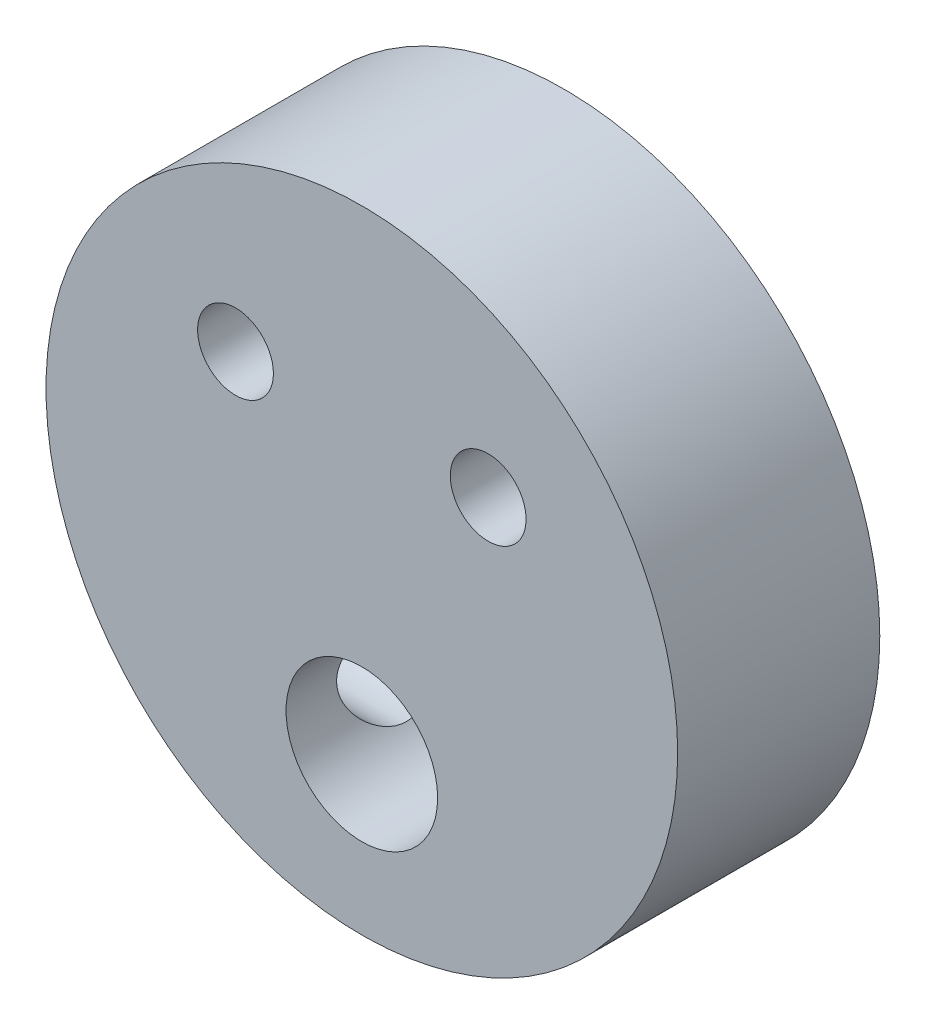
ISO-10303-21;
HEADER;
FILE_DESCRIPTION(('STEP AP214'),'2;1');
FILE_NAME('part.step','',(''),(''),'','','');
FILE_SCHEMA(('AUTOMOTIVE_DESIGN { 1 0 10303 214 1 1 1 1 }'));
ENDSEC;
DATA;
#1=APPLICATION_CONTEXT('core data for automotive mechanical design processes');
#2=APPLICATION_PROTOCOL_DEFINITION('international standard','automotive_design',2000,#1);
#3=PRODUCT_CONTEXT('',#1,'mechanical');
#4=PRODUCT('Part','Part','',(#3));
#5=PRODUCT_RELATED_PRODUCT_CATEGORY('part','',(#4));
#6=PRODUCT_DEFINITION_FORMATION('','',#4);
#7=PRODUCT_DEFINITION_CONTEXT('part definition',#1,'design');
#8=PRODUCT_DEFINITION('design','',#6,#7);
#9=PRODUCT_DEFINITION_SHAPE('','',#8);
#10=(LENGTH_UNIT() NAMED_UNIT(*) SI_UNIT(.MILLI.,.METRE.));
#11=(NAMED_UNIT(*) PLANE_ANGLE_UNIT() SI_UNIT($,.RADIAN.));
#12=(NAMED_UNIT(*) SI_UNIT($,.STERADIAN.) SOLID_ANGLE_UNIT());
#13=UNCERTAINTY_MEASURE_WITH_UNIT(LENGTH_MEASURE(1.E-05),#10,'distance_accuracy_value','');
#14=(GEOMETRIC_REPRESENTATION_CONTEXT(3) GLOBAL_UNCERTAINTY_ASSIGNED_CONTEXT((#13)) GLOBAL_UNIT_ASSIGNED_CONTEXT((#10,
#11,#12)) REPRESENTATION_CONTEXT('',''));
#15=CARTESIAN_POINT('',(0.,0.,0.));
#16=DIRECTION('',(0.,0.,1.));
#17=DIRECTION('',(1.,0.,0.));
#18=AXIS2_PLACEMENT_3D('',#15,#16,#17);
#19=CARTESIAN_POINT('',(0.,0.,8.));
#20=DIRECTION('',(0.,0.,1.));
#21=DIRECTION('',(1.,0.,0.));
#22=AXIS2_PLACEMENT_3D('',#19,#20,#21);
#23=PLANE('',#22);
#24=CARTESIAN_POINT('',(5.,5.,8.));
#25=DIRECTION('',(0.,0.,1.));
#26=DIRECTION('',(-1.,0.,0.));
#27=AXIS2_PLACEMENT_3D('',#24,#25,#26);
#28=CIRCLE('',#27,1.5);
#29=CARTESIAN_POINT('',(3.5,5.,8.));
#30=VERTEX_POINT('',#29);
#31=EDGE_CURVE('E110',#30,#30,#28,.T.);
#32=ORIENTED_EDGE('',*,*,#31,.F.);
#33=EDGE_LOOP('',(#32));
#34=FACE_BOUND('',#33,.T.);
#35=CARTESIAN_POINT('',(-5.,5.,8.));
#36=DIRECTION('',(0.,0.,1.));
#37=DIRECTION('',(1.,0.,0.));
#38=AXIS2_PLACEMENT_3D('',#35,#36,#37);
#39=CIRCLE('',#38,1.5);
#40=CARTESIAN_POINT('',(-3.5,5.,8.));
#41=VERTEX_POINT('',#40);
#42=EDGE_CURVE('E69',#41,#41,#39,.T.);
#43=ORIENTED_EDGE('',*,*,#42,.F.);
#44=EDGE_LOOP('',(#43));
#45=FACE_BOUND('',#44,.T.);
#46=CARTESIAN_POINT('',(0.,0.,8.));
#47=DIRECTION('',(0.,0.,1.));
#48=DIRECTION('',(1.,0.,0.));
#49=AXIS2_PLACEMENT_3D('',#46,#47,#48);
#50=CIRCLE('',#49,12.5);
#51=CARTESIAN_POINT('',(12.5,0.,8.));
#52=VERTEX_POINT('',#51);
#53=EDGE_CURVE('E10',#52,#52,#50,.T.);
#54=ORIENTED_EDGE('',*,*,#53,.T.);
#55=EDGE_LOOP('',(#54));
#56=FACE_BOUND('',#55,.T.);
#57=CARTESIAN_POINT('',(0.,-6.3,8.));
#58=DIRECTION('',(0.,0.,1.));
#59=DIRECTION('',(1.,0.,0.));
#60=AXIS2_PLACEMENT_3D('',#57,#58,#59);
#61=CIRCLE('',#60,3.);
#62=CARTESIAN_POINT('',(3.,-6.3,8.));
#63=VERTEX_POINT('',#62);
#64=EDGE_CURVE('E57',#63,#63,#61,.T.);
#65=ORIENTED_EDGE('',*,*,#64,.F.);
#66=EDGE_LOOP('',(#65));
#67=FACE_BOUND('',#66,.T.);
#68=ADVANCED_FACE('F39',(#34,#45,#56,#67),#23,.T.);
#69=CARTESIAN_POINT('',(0.,0.,0.));
#70=DIRECTION('',(0.,0.,1.));
#71=DIRECTION('',(1.,0.,0.));
#72=AXIS2_PLACEMENT_3D('',#69,#70,#71);
#73=PLANE('',#72);
#74=CARTESIAN_POINT('',(5.,5.,0.));
#75=DIRECTION('',(0.,0.,1.));
#76=DIRECTION('',(-1.,0.,0.));
#77=AXIS2_PLACEMENT_3D('',#74,#75,#76);
#78=CIRCLE('',#77,1.5);
#79=CARTESIAN_POINT('',(3.5,5.,0.));
#80=VERTEX_POINT('',#79);
#81=EDGE_CURVE('E96',#80,#80,#78,.T.);
#82=ORIENTED_EDGE('',*,*,#81,.T.);
#83=EDGE_LOOP('',(#82));
#84=FACE_BOUND('',#83,.T.);
#85=CARTESIAN_POINT('',(-5.,5.,0.));
#86=DIRECTION('',(0.,0.,1.));
#87=DIRECTION('',(1.,0.,0.));
#88=AXIS2_PLACEMENT_3D('',#85,#86,#87);
#89=CIRCLE('',#88,1.5);
#90=CARTESIAN_POINT('',(-3.5,5.,0.));
#91=VERTEX_POINT('',#90);
#92=EDGE_CURVE('E100',#91,#91,#89,.T.);
#93=ORIENTED_EDGE('',*,*,#92,.T.);
#94=EDGE_LOOP('',(#93));
#95=FACE_BOUND('',#94,.T.);
#96=CARTESIAN_POINT('',(0.,0.,0.));
#97=DIRECTION('',(0.,0.,1.));
#98=DIRECTION('',(1.,0.,0.));
#99=AXIS2_PLACEMENT_3D('',#96,#97,#98);
#100=CIRCLE('',#99,12.5);
#101=CARTESIAN_POINT('',(12.5,0.,0.));
#102=VERTEX_POINT('',#101);
#103=EDGE_CURVE('E52',#102,#102,#100,.T.);
#104=ORIENTED_EDGE('',*,*,#103,.F.);
#105=EDGE_LOOP('',(#104));
#106=FACE_BOUND('',#105,.T.);
#107=CARTESIAN_POINT('',(0.,-6.3,0.));
#108=DIRECTION('',(0.,0.,1.));
#109=DIRECTION('',(1.,0.,0.));
#110=AXIS2_PLACEMENT_3D('',#107,#108,#109);
#111=CIRCLE('',#110,3.);
#112=CARTESIAN_POINT('',(3.,-6.3,0.));
#113=VERTEX_POINT('',#112);
#114=EDGE_CURVE('E59',#113,#113,#111,.T.);
#115=ORIENTED_EDGE('',*,*,#114,.T.);
#116=EDGE_LOOP('',(#115));
#117=FACE_BOUND('',#116,.T.);
#118=ADVANCED_FACE('F85',(#84,#95,#106,#117),#73,.F.);
#119=CARTESIAN_POINT('',(0.,0.,8.));
#120=DIRECTION('',(0.,0.,-1.));
#121=DIRECTION('',(-1.,0.,0.));
#122=AXIS2_PLACEMENT_3D('',#119,#120,#121);
#123=CYLINDRICAL_SURFACE('',#122,12.5);
#124=CARTESIAN_POINT('',(-10.7962956610126,-6.3,2.));
#125=CARTESIAN_POINT('',(-10.8649366877148,-6.18237069527315,2.00000130589695));
#126=CARTESIAN_POINT('',(-10.9316469644138,-6.06359707464161,2.01038122678109));
#127=CARTESIAN_POINT('',(-11.0595852579452,-5.82697504599017,2.05303242275279));
#128=CARTESIAN_POINT('',(-11.1208149189282,-5.70912637023689,2.08529710746416));
#129=CARTESIAN_POINT('',(-11.2366156917357,-5.47770950958708,2.17264897036098));
#130=CARTESIAN_POINT('',(-11.2911478564412,-5.36416879230078,2.22786214444508));
#131=CARTESIAN_POINT('',(-11.3917974879485,-5.14696770871515,2.36088451895591));
#132=CARTESIAN_POINT('',(-11.4379196143042,-5.04330188656248,2.4386811447825));
#133=CARTESIAN_POINT('',(-11.5164507400641,-4.86109053362144,2.6060049443053));
#134=CARTESIAN_POINT('',(-11.5497864743858,-4.7810542384566,2.69347456989609));
#135=CARTESIAN_POINT('',(-11.6084601444414,-4.63678062814349,2.88292787855692));
#136=CARTESIAN_POINT('',(-11.6338027053872,-4.57253418104383,2.98490311826686));
#137=CARTESIAN_POINT('',(-11.6743991790149,-4.46780589376754,3.19056069419096));
#138=CARTESIAN_POINT('',(-11.6903469598331,-4.42572515947065,3.29329497593935));
#139=CARTESIAN_POINT('',(-11.7153799535084,-4.35903139287314,3.50507386514289));
#140=CARTESIAN_POINT('',(-11.7244671983475,-4.33441318857895,3.61411659382622));
#141=CARTESIAN_POINT('',(-11.7355372653604,-4.30434778295202,3.8303587168017));
#142=CARTESIAN_POINT('',(-11.7378086174888,-4.29812217344296,3.93743594255018));
#143=CARTESIAN_POINT('',(-11.7360731241747,-4.30285893359846,4.15115240151094));
#144=CARTESIAN_POINT('',(-11.7320669912979,-4.31381935245423,4.25779168305726));
#145=CARTESIAN_POINT('',(-11.7178552784849,-4.35227237257084,4.4663402921219));
#146=CARTESIAN_POINT('',(-11.7077211519571,-4.37957439139583,4.5682897767546));
#147=CARTESIAN_POINT('',(-11.6813226067318,-4.44950438714808,4.7659340206541));
#148=CARTESIAN_POINT('',(-11.6650582061838,-4.49213231870093,4.86162879843779));
#149=CARTESIAN_POINT('',(-11.6262170848826,-4.59172674054136,5.04539886555993));
#150=CARTESIAN_POINT('',(-11.6035652991023,-4.64886288545767,5.13336615294694));
#151=CARTESIAN_POINT('',(-11.5521943870411,-4.77508498007818,5.2982367835111));
#152=CARTESIAN_POINT('',(-11.5234745549987,-4.84417231963085,5.37513883796404));
#153=CARTESIAN_POINT('',(-11.4590005574753,-4.99482389638299,5.51914422665209));
#154=CARTESIAN_POINT('',(-11.4230124959399,-5.07677442862093,5.58573768811275));
#155=CARTESIAN_POINT('',(-11.3452868138284,-5.2481733459533,5.70426799246006));
#156=CARTESIAN_POINT('',(-11.3035476561078,-5.33762373308718,5.75620090554477));
#157=CARTESIAN_POINT('',(-11.2116368543699,-5.52821826276422,5.84834545275278));
#158=CARTESIAN_POINT('',(-11.1610673487076,-5.62973611235101,5.88738399616389));
#159=CARTESIAN_POINT('',(-11.0549846242545,-5.8352992017499,5.94821962988211));
#160=CARTESIAN_POINT('',(-10.9994692688457,-5.93934551961244,5.97000922802997));
#161=CARTESIAN_POINT('',(-10.8782307360474,-6.1588530183683,5.99840701917676));
#162=CARTESIAN_POINT('',(-10.8120559901808,-6.27431342400384,6.00308605060478));
#163=CARTESIAN_POINT('',(-10.6764403556972,-6.5024046531181,5.99300838473509));
#164=CARTESIAN_POINT('',(-10.606998201105,-6.61503435345942,5.97824409321704));
#165=CARTESIAN_POINT('',(-10.4581677528888,-6.84821240663778,5.9275184794899));
#166=CARTESIAN_POINT('',(-10.3785707443632,-6.9681326575348,5.88926695762781));
#167=CARTESIAN_POINT('',(-10.2196942240947,-7.19913526530239,5.79090577079903));
#168=CARTESIAN_POINT('',(-10.1404153085222,-7.31020508775293,5.73076575411207));
#169=CARTESIAN_POINT('',(-9.98085627080246,-7.52672460793877,5.58528607459298));
#170=CARTESIAN_POINT('',(-9.90077491993191,-7.63149704771814,5.49870940322805));
#171=CARTESIAN_POINT('',(-9.74928480399286,-7.82408942338587,5.30229510962414));
#172=CARTESIAN_POINT('',(-9.67785399950012,-7.91195279121945,5.19251864316908));
#173=CARTESIAN_POINT('',(-9.5733086834854,-8.03777938274011,4.99424705237903));
#174=CARTESIAN_POINT('',(-9.53565347841991,-8.08232390502388,4.91229888936658));
#175=CARTESIAN_POINT('',(-9.46889367859734,-8.16043409323015,4.74006735663763));
#176=CARTESIAN_POINT('',(-9.43978068607288,-8.19401054546248,4.64979228858687));
#177=CARTESIAN_POINT('',(-9.39225727482981,-8.24844507439244,4.46175409933778));
#178=CARTESIAN_POINT('',(-9.37394727040775,-8.2691839094925,4.36392999540332));
#179=CARTESIAN_POINT('',(-9.35046918663304,-8.29572563742649,4.16474035759088));
#180=CARTESIAN_POINT('',(-9.34528867190936,-8.30154266325972,4.06337826699305));
#181=CARTESIAN_POINT('',(-9.34842369975954,-8.29800927813179,3.87520890616928));
#182=CARTESIAN_POINT('',(-9.35497524291072,-8.29064142019131,3.78832363424958));
#183=CARTESIAN_POINT('',(-9.3776541007723,-8.26497991884146,3.61748799264687));
#184=CARTESIAN_POINT('',(-9.39378266281148,-8.24668485225025,3.53353800676934));
#185=CARTESIAN_POINT('',(-9.43427964734514,-8.20032307385571,3.37077498801068));
#186=CARTESIAN_POINT('',(-9.45862725254706,-8.17228104400903,3.29194957121306));
#187=CARTESIAN_POINT('',(-9.51402378868507,-8.10772241022006,3.14038509755485));
#188=CARTESIAN_POINT('',(-9.54507691297166,-8.07120050223717,3.06764988893481));
#189=CARTESIAN_POINT('',(-9.62792375817383,-7.97238405375417,2.89689193821969));
#190=CARTESIAN_POINT('',(-9.6826779654831,-7.90597149180829,2.80267727519787));
#191=CARTESIAN_POINT('',(-9.79936604220943,-7.76087124565528,2.62935158943545));
#192=CARTESIAN_POINT('',(-9.86131186702781,-7.6821630438064,2.55026631277227));
#193=CARTESIAN_POINT('',(-9.9903765785454,-7.51357545136832,2.40635656153163));
#194=CARTESIAN_POINT('',(-10.0575612924677,-7.42354039940732,2.34177484910889));
#195=CARTESIAN_POINT('',(-10.1938434968195,-7.23526596644374,2.22874758871046));
#196=CARTESIAN_POINT('',(-10.2629407035567,-7.13702779794822,2.1802996612533));
#197=CARTESIAN_POINT('',(-10.4109491349442,-6.91966349227609,2.09434319788151));
#198=CARTESIAN_POINT('',(-10.4898710563053,-6.7995447725347,2.05933867639567));
#199=CARTESIAN_POINT('',(-10.6453818655481,-6.55339812138086,2.01216580951527));
#200=CARTESIAN_POINT('',(-10.7219706386359,-6.42736989998568,1.99999858596491));
#201=CARTESIAN_POINT('',(-10.7962956610126,-6.3,2.));
#202=B_SPLINE_CURVE_WITH_KNOTS('',3,(#124,#125,#126,#127,#128,#129,#130,#131,#132,#133,#134,
#135,#136,#137,#138,#139,#140,#141,#142,#143,#144,#145,#146,#147,#148,#149,#150,#151,#152,#153,
#154,#155,#156,#157,#158,#159,#160,#161,#162,#163,#164,#165,#166,#167,#168,#169,#170,#171,#172,
#173,#174,#175,#176,#177,#178,#179,#180,#181,#182,#183,#184,#185,#186,#187,#188,#189,#190,#191,
#192,#193,#194,#195,#196,#197,#198,#199,#200,#201),.UNSPECIFIED.,.T.,.F.,(4,2,2,2,2,2,2,2,2,2,2,
2,2,2,2,2,2,2,2,2,2,2,2,2,2,2,2,2,2,2,2,2,2,2,2,2,2,2,4),(0.,0.40813309128024,0.816143331924971,
1.22642393041372,1.63647651898227,2.00394061916668,2.37119169622337,2.70597302396906,
3.04065515585564,3.36095431390031,3.68121711699623,3.99781573503227,4.31441341574347,
4.63489904343964,4.95542196667756,5.28866277765706,5.62199283015434,5.98035461234499,
6.33887196535769,6.7367463897825,7.13477626306711,7.57965072963226,8.0251444472132,
8.49593480500251,8.96549928014663,9.26617336355885,9.5665508590994,9.86967810091383,
10.1725181334835,10.433561190823,10.6946382543563,10.9550589592419,11.2156429944047,
11.5964053629921,11.977810030889,12.3651884864,12.7525097843064,13.1944176720484,
13.6363472672111),.UNSPECIFIED.);
#203=CARTESIAN_POINT('',(-10.7962956610126,-6.3,2.));
#204=VERTEX_POINT('',#203);
#205=EDGE_CURVE('E62',#204,#204,#202,.T.);
#206=ORIENTED_EDGE('',*,*,#205,.T.);
#207=EDGE_LOOP('',(#206));
#208=FACE_BOUND('',#207,.T.);
#209=ORIENTED_EDGE('',*,*,#53,.F.);
#210=EDGE_LOOP('',(#209));
#211=FACE_BOUND('',#210,.T.);
#212=ORIENTED_EDGE('',*,*,#103,.T.);
#213=EDGE_LOOP('',(#212));
#214=FACE_BOUND('',#213,.T.);
#215=ADVANCED_FACE('F41',(#208,#211,#214),#123,.T.);
#216=CARTESIAN_POINT('',(0.,-6.3,8.));
#217=DIRECTION('',(0.,0.,-1.));
#218=DIRECTION('',(-1.,0.,0.));
#219=AXIS2_PLACEMENT_3D('',#216,#217,#218);
#220=CYLINDRICAL_SURFACE('',#219,3.);
#221=CARTESIAN_POINT('',(-3.,-6.3,6.));
#222=CARTESIAN_POINT('',(-3.00000041644839,-6.40048471666808,6.00000054963247));
#223=CARTESIAN_POINT('',(-2.99490802753388,-6.5009690871329,5.9923860300445));
#224=CARTESIAN_POINT('',(-2.97504652423808,-6.69873305803168,5.96240313589434));
#225=CARTESIAN_POINT('',(-2.96027281581235,-6.79601111395501,5.94002775687671));
#226=CARTESIAN_POINT('',(-2.92250482404708,-6.98421230785425,5.88189228267516));
#227=CARTESIAN_POINT('',(-2.89954905493315,-7.07516287265755,5.84619485999206));
#228=CARTESIAN_POINT('',(-2.8472613787744,-7.24941529099726,5.7629366367285));
#229=CARTESIAN_POINT('',(-2.8179285460551,-7.33271603160967,5.71537411369944));
#230=CARTESIAN_POINT('',(-2.75227329369838,-7.49728470077011,5.60534306263257));
#231=CARTESIAN_POINT('',(-2.71556897579319,-7.57778030546068,5.54195213925711));
#232=CARTESIAN_POINT('',(-2.63982313083466,-7.72772804469274,5.40426995134155));
#233=CARTESIAN_POINT('',(-2.60077830356832,-7.79716405543888,5.32996307016226));
#234=CARTESIAN_POINT('',(-2.51728264678793,-7.93422297745496,5.15894763238733));
#235=CARTESIAN_POINT('',(-2.47295067937795,-7.9998318636275,5.06055434679655));
#236=CARTESIAN_POINT('',(-2.3908414735282,-8.11350357014175,4.85163662235347));
#237=CARTESIAN_POINT('',(-2.35305295954667,-8.16159673426503,4.74113359843726));
#238=CARTESIAN_POINT('',(-2.2997626664146,-8.22674035011438,4.54328870657837));
#239=CARTESIAN_POINT('',(-2.28097627892403,-8.24874447236008,4.45847154712609));
#240=CARTESIAN_POINT('',(-2.25257969659604,-8.28150617785229,4.28525549525835));
#241=CARTESIAN_POINT('',(-2.24295368744147,-8.29228314651963,4.19686305127394));
#242=CARTESIAN_POINT('',(-2.23436605608045,-8.30191364141228,4.01852522114353));
#243=CARTESIAN_POINT('',(-2.23544802558502,-8.30071842917524,3.9285749765476));
#244=CARTESIAN_POINT('',(-2.24819775483425,-8.28637581333356,3.75036502650025));
#245=CARTESIAN_POINT('',(-2.25987448286881,-8.27321828380393,3.66210681797187));
#246=CARTESIAN_POINT('',(-2.29127185989959,-8.23664994217326,3.49353294875812));
#247=CARTESIAN_POINT('',(-2.31061488324375,-8.21371711479477,3.41303866406123));
#248=CARTESIAN_POINT('',(-2.35509622933623,-8.15870118583424,3.25697630902422));
#249=CARTESIAN_POINT('',(-2.38023645854889,-8.1266150732855,3.18140986976135));
#250=CARTESIAN_POINT('',(-2.43964196377947,-8.04673818732649,3.02097460464356));
#251=CARTESIAN_POINT('',(-2.47472317740626,-7.99708052300445,2.93734009951691));
#252=CARTESIAN_POINT('',(-2.54691537733438,-7.88668960438221,2.77861660471425));
#253=CARTESIAN_POINT('',(-2.58402882709328,-7.82594268999614,2.70353834223793));
#254=CARTESIAN_POINT('',(-2.66543343763724,-7.67981165322309,2.54745745439658));
#255=CARTESIAN_POINT('',(-2.7095474472056,-7.59193938283656,2.46866595131724));
#256=CARTESIAN_POINT('',(-2.79218100665211,-7.40200799908008,2.32680350546152));
#257=CARTESIAN_POINT('',(-2.83070577648042,-7.2999622993437,2.26371785459102));
#258=CARTESIAN_POINT('',(-2.89145404090364,-7.10485782709653,2.16652228137713));
#259=CARTESIAN_POINT('',(-2.91539261165539,-7.01395764337191,2.12915663666106));
#260=CARTESIAN_POINT('',(-2.95507719030498,-6.82603604393548,2.06789507437463));
#261=CARTESIAN_POINT('',(-2.97083012127543,-6.72901987900165,2.04398777286779));
#262=CARTESIAN_POINT('',(-2.99275882156808,-6.53098545317228,2.010838834762));
#263=CARTESIAN_POINT('',(-2.99889322461186,-6.42995181193416,2.00166053906174));
#264=CARTESIAN_POINT('',(-3.00083114965146,-6.22755848061066,1.99875291143779));
#265=CARTESIAN_POINT('',(-2.99663539385634,-6.12619881381338,2.00502249951123));
#266=CARTESIAN_POINT('',(-2.97899589424273,-5.93354428279576,2.03162405556195));
#267=CARTESIAN_POINT('',(-2.96622246390226,-5.84204255532081,2.05093729775522));
#268=CARTESIAN_POINT('',(-2.93318449284837,-5.6638836075726,2.10159568601286));
#269=CARTESIAN_POINT('',(-2.91291875746988,-5.57722716242887,2.13294275092821));
#270=CARTESIAN_POINT('',(-2.86496352529157,-5.40533524953401,2.20865229704492));
#271=CARTESIAN_POINT('',(-2.83689870135785,-5.32050381536858,2.25368815408185));
#272=CARTESIAN_POINT('',(-2.7760185561151,-5.15931697604271,2.35443328994627));
#273=CARTESIAN_POINT('',(-2.74320030403941,-5.08296685179909,2.41014916053217));
#274=CARTESIAN_POINT('',(-2.6695454665343,-4.92814554517676,2.54060786815751));
#275=CARTESIAN_POINT('',(-2.62826156800165,-4.85124812430435,2.61696626007509));
#276=CARTESIAN_POINT('',(-2.54571173085957,-4.71066031930551,2.78111142995711));
#277=CARTESIAN_POINT('',(-2.50444582417845,-4.6469790634277,2.8689060391075));
#278=CARTESIAN_POINT('',(-2.4293967897058,-4.53875223450687,3.04714241276812));
#279=CARTESIAN_POINT('',(-2.39527597025701,-4.49304363874717,3.13673203346221));
#280=CARTESIAN_POINT('',(-2.33438974266154,-4.41503786259736,3.32387265244363));
#281=CARTESIAN_POINT('',(-2.30761112529821,-4.38271654317811,3.42140893830462));
#282=CARTESIAN_POINT('',(-2.26933208182632,-4.3376415653466,3.60456448719541));
#283=CARTESIAN_POINT('',(-2.25594998021257,-4.32241402433775,3.68917180987601));
#284=CARTESIAN_POINT('',(-2.23879466438398,-4.30300794076627,3.86057328131838));
#285=CARTESIAN_POINT('',(-2.23501101347816,-4.29881739714683,3.94736495113949));
#286=CARTESIAN_POINT('',(-2.23764201149981,-4.30176078018734,4.12064305672369));
#287=CARTESIAN_POINT('',(-2.24406269907463,-4.30890141232216,4.20712928137375));
#288=CARTESIAN_POINT('',(-2.26610452403491,-4.33403002775254,4.37734352853211));
#289=CARTESIAN_POINT('',(-2.28173793527615,-4.35203248271742,4.46106771382432));
#290=CARTESIAN_POINT('',(-2.325268439048,-4.40406964342506,4.64571118648123));
#291=CARTESIAN_POINT('',(-2.35532333574982,-4.44109812869235,4.74526771294332));
#292=CARTESIAN_POINT('',(-2.42222161121309,-4.52915473763779,4.9354868343842));
#293=CARTESIAN_POINT('',(-2.45907449686699,-4.58020251658741,5.02613669799169));
#294=CARTESIAN_POINT('',(-2.53617186577119,-4.69601719444847,5.19928188713623));
#295=CARTESIAN_POINT('',(-2.5764658739228,-4.76101690105979,5.28159874542305));
#296=CARTESIAN_POINT('',(-2.65628301537844,-4.90328231968905,5.43532247825793));
#297=CARTESIAN_POINT('',(-2.69580590832396,-4.98055178974251,5.50672599702921));
#298=CARTESIAN_POINT('',(-2.77631551964082,-5.15854267023026,5.64671210430908));
#299=CARTESIAN_POINT('',(-2.81669805449991,-5.26103833044425,5.71341864017832));
#300=CARTESIAN_POINT('',(-2.88777665874161,-5.47913144422878,5.8279132766653));
#301=CARTESIAN_POINT('',(-2.91848793445255,-5.59470793755084,5.87573110682395));
#302=CARTESIAN_POINT('',(-2.96101644836895,-5.80856493016425,5.94115457816378));
#303=CARTESIAN_POINT('',(-2.97551480368934,-5.90498767474208,5.96311103909862));
#304=CARTESIAN_POINT('',(-2.99500280141853,-6.10094198797605,5.9925280325381));
#305=CARTESIAN_POINT('',(-2.99999958751315,-6.20047116381199,5.99999945559601));
#306=CARTESIAN_POINT('',(-3.,-6.3,6.));
#307=B_SPLINE_CURVE_WITH_KNOTS('',3,(#221,#222,#223,#224,#225,#226,#227,#228,#229,#230,#231,
#232,#233,#234,#235,#236,#237,#238,#239,#240,#241,#242,#243,#244,#245,#246,#247,#248,#249,#250,
#251,#252,#253,#254,#255,#256,#257,#258,#259,#260,#261,#262,#263,#264,#265,#266,#267,#268,#269,
#270,#271,#272,#273,#274,#275,#276,#277,#278,#279,#280,#281,#282,#283,#284,#285,#286,#287,#288,
#289,#290,#291,#292,#293,#294,#295,#296,#297,#298,#299,#300,#301,#302,#303,#304,#305,#306),
.UNSPECIFIED.,.T.,.F.,(4,2,2,2,2,2,2,2,2,2,2,2,2,2,2,2,2,2,2,2,2,2,2,2,2,2,2,2,2,2,2,2,2,2,2,2,
2,2,2,2,2,2,4),(0.,0.3010532265054,0.602249414348688,0.902046153190232,1.20188643867387,
1.52717029000557,1.85292411604319,2.23006683295982,2.60655305445439,2.87433693676029,
3.14165767845809,3.41006711735378,3.67870397263352,3.93548862198022,4.19235783805079,
4.50147574660873,4.81097703780057,5.18718954496752,5.56304840301362,5.86524087696758,
6.16717735142813,6.47040883294251,6.77361911533415,7.05553084792472,7.3374875513827,
7.63652346829516,7.93574454945204,8.28228176141291,8.62905753175758,8.94649935304476,
9.26336626640723,9.52324048016135,9.78283200333091,10.0425772028455,10.302669238524,
10.6320660870419,10.9619271337795,11.2977924520448,11.6337608397015,12.0179535155883,
12.4015390656083,12.6999529136674,12.9981423125957),.UNSPECIFIED.);
#308=CARTESIAN_POINT('',(-3.,-6.3,6.));
#309=VERTEX_POINT('',#308);
#310=EDGE_CURVE('E44',#309,#309,#307,.T.);
#311=ORIENTED_EDGE('',*,*,#310,.F.);
#312=EDGE_LOOP('',(#311));
#313=FACE_BOUND('',#312,.T.);
#314=ORIENTED_EDGE('',*,*,#64,.T.);
#315=EDGE_LOOP('',(#314));
#316=FACE_BOUND('',#315,.T.);
#317=ORIENTED_EDGE('',*,*,#114,.F.);
#318=EDGE_LOOP('',(#317));
#319=FACE_BOUND('',#318,.T.);
#320=ADVANCED_FACE('F76',(#313,#316,#319),#220,.F.);
#321=CARTESIAN_POINT('',(-12.5,-6.3,4.));
#322=DIRECTION('',(1.,0.,0.));
#323=DIRECTION('',(0.,0.,-1.));
#324=AXIS2_PLACEMENT_3D('',#321,#322,#323);
#325=CYLINDRICAL_SURFACE('',#324,2.);
#326=ORIENTED_EDGE('',*,*,#310,.T.);
#327=EDGE_LOOP('',(#326));
#328=FACE_BOUND('',#327,.T.);
#329=ORIENTED_EDGE('',*,*,#205,.F.);
#330=EDGE_LOOP('',(#329));
#331=FACE_BOUND('',#330,.T.);
#332=ADVANCED_FACE('F71',(#328,#331),#325,.F.);
#333=CARTESIAN_POINT('',(-5.,5.,0.));
#334=DIRECTION('',(0.,0.,1.));
#335=DIRECTION('',(1.,0.,0.));
#336=AXIS2_PLACEMENT_3D('',#333,#334,#335);
#337=CYLINDRICAL_SURFACE('',#336,1.5);
#338=ORIENTED_EDGE('',*,*,#92,.F.);
#339=EDGE_LOOP('',(#338));
#340=FACE_BOUND('',#339,.T.);
#341=ORIENTED_EDGE('',*,*,#42,.T.);
#342=EDGE_LOOP('',(#341));
#343=FACE_BOUND('',#342,.T.);
#344=ADVANCED_FACE('F75',(#340,#343),#337,.F.);
#345=CARTESIAN_POINT('',(5.,5.,0.));
#346=DIRECTION('',(0.,0.,1.));
#347=DIRECTION('',(1.,0.,0.));
#348=AXIS2_PLACEMENT_3D('',#345,#346,#347);
#349=CYLINDRICAL_SURFACE('',#348,1.5);
#350=ORIENTED_EDGE('',*,*,#81,.F.);
#351=EDGE_LOOP('',(#350));
#352=FACE_BOUND('',#351,.T.);
#353=ORIENTED_EDGE('',*,*,#31,.T.);
#354=EDGE_LOOP('',(#353));
#355=FACE_BOUND('',#354,.T.);
#356=ADVANCED_FACE('F115',(#352,#355),#349,.F.);
#357=CLOSED_SHELL('',(#68,#118,#215,#320,#332,#344,#356));
#358=MANIFOLD_SOLID_BREP('B2',#357);
#359=ADVANCED_BREP_SHAPE_REPRESENTATION('',(#18,#358),#14);
#360=SHAPE_DEFINITION_REPRESENTATION(#9,#359);
ENDSEC;
END-ISO-10303-21;
